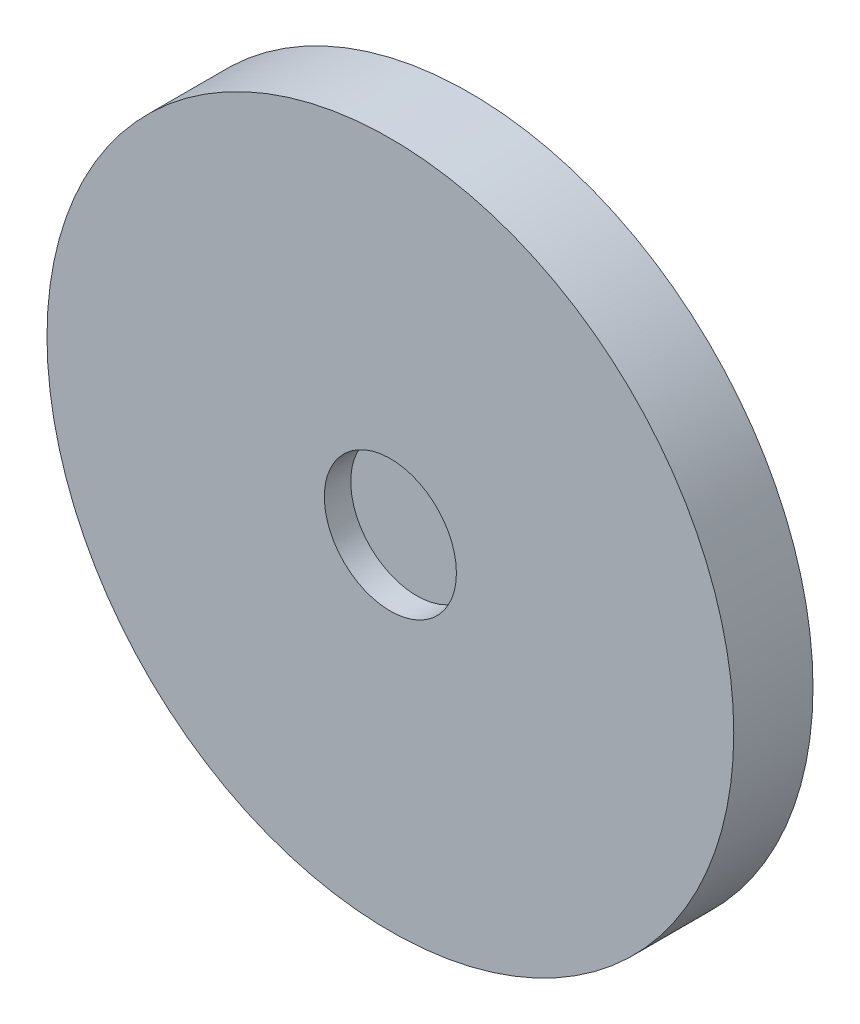
ISO-10303-21;
HEADER;
FILE_DESCRIPTION(('STEP AP214'),'2;1');
FILE_NAME('part.step','',(''),(''),'','','');
FILE_SCHEMA(('AUTOMOTIVE_DESIGN { 1 0 10303 214 1 1 1 1 }'));
ENDSEC;
DATA;
#1=APPLICATION_CONTEXT('core data for automotive mechanical design processes');
#2=APPLICATION_PROTOCOL_DEFINITION('international standard','automotive_design',2000,#1);
#3=PRODUCT_CONTEXT('',#1,'mechanical');
#4=PRODUCT('Part','Part','',(#3));
#5=PRODUCT_RELATED_PRODUCT_CATEGORY('part','',(#4));
#6=PRODUCT_DEFINITION_FORMATION('','',#4);
#7=PRODUCT_DEFINITION_CONTEXT('part definition',#1,'design');
#8=PRODUCT_DEFINITION('design','',#6,#7);
#9=PRODUCT_DEFINITION_SHAPE('','',#8);
#10=(LENGTH_UNIT() NAMED_UNIT(*) SI_UNIT(.MILLI.,.METRE.));
#11=(NAMED_UNIT(*) PLANE_ANGLE_UNIT() SI_UNIT($,.RADIAN.));
#12=(NAMED_UNIT(*) SI_UNIT($,.STERADIAN.) SOLID_ANGLE_UNIT());
#13=UNCERTAINTY_MEASURE_WITH_UNIT(LENGTH_MEASURE(1.E-05),#10,'distance_accuracy_value','');
#14=(GEOMETRIC_REPRESENTATION_CONTEXT(3) GLOBAL_UNCERTAINTY_ASSIGNED_CONTEXT((#13)) GLOBAL_UNIT_ASSIGNED_CONTEXT((#10,
#11,#12)) REPRESENTATION_CONTEXT('',''));
#15=CARTESIAN_POINT('',(0.,0.,0.));
#16=DIRECTION('',(0.,0.,1.));
#17=DIRECTION('',(1.,0.,0.));
#18=AXIS2_PLACEMENT_3D('',#15,#16,#17);
#19=CARTESIAN_POINT('',(0.,0.,0.6));
#20=DIRECTION('',(0.,0.,1.));
#21=DIRECTION('',(1.,0.,0.));
#22=AXIS2_PLACEMENT_3D('',#19,#20,#21);
#23=PLANE('',#22);
#24=CARTESIAN_POINT('',(0.,0.,0.6));
#25=DIRECTION('',(0.,0.,1.));
#26=DIRECTION('',(1.,0.,0.));
#27=AXIS2_PLACEMENT_3D('',#24,#25,#26);
#28=CIRCLE('',#27,0.75);
#29=CARTESIAN_POINT('',(0.75,0.,0.6));
#30=VERTEX_POINT('',#29);
#31=EDGE_CURVE('E18',#30,#30,#28,.T.);
#32=ORIENTED_EDGE('',*,*,#31,.T.);
#33=EDGE_LOOP('',(#32));
#34=FACE_BOUND('',#33,.T.);
#35=ADVANCED_FACE('F15',(#34),#23,.T.);
#36=CARTESIAN_POINT('',(0.,0.,0.6));
#37=DIRECTION('',(0.,0.,1.));
#38=DIRECTION('',(1.,0.,0.));
#39=AXIS2_PLACEMENT_3D('',#36,#37,#38);
#40=CYLINDRICAL_SURFACE('',#39,0.75);
#41=CARTESIAN_POINT('',(0.,0.,0.9));
#42=DIRECTION('',(0.,0.,1.));
#43=DIRECTION('',(1.,0.,0.));
#44=AXIS2_PLACEMENT_3D('',#41,#42,#43);
#45=CIRCLE('',#44,0.75);
#46=CARTESIAN_POINT('',(0.75,0.,0.9));
#47=VERTEX_POINT('',#46);
#48=EDGE_CURVE('E27',#47,#47,#45,.F.);
#49=ORIENTED_EDGE('',*,*,#48,.F.);
#50=EDGE_LOOP('',(#49));
#51=FACE_BOUND('',#50,.T.);
#52=ORIENTED_EDGE('',*,*,#31,.F.);
#53=EDGE_LOOP('',(#52));
#54=FACE_BOUND('',#53,.T.);
#55=ADVANCED_FACE('F36',(#51,#54),#40,.F.);
#56=CARTESIAN_POINT('',(0.,0.,0.9));
#57=DIRECTION('',(0.,0.,1.));
#58=DIRECTION('',(1.,0.,0.));
#59=AXIS2_PLACEMENT_3D('',#56,#57,#58);
#60=PLANE('',#59);
#61=CARTESIAN_POINT('',(0.,0.,0.9));
#62=DIRECTION('',(0.,0.,-1.));
#63=DIRECTION('',(-1.,0.,0.));
#64=AXIS2_PLACEMENT_3D('',#61,#62,#63);
#65=CIRCLE('',#64,3.9);
#66=CARTESIAN_POINT('',(-3.9,0.,0.9));
#67=VERTEX_POINT('',#66);
#68=EDGE_CURVE('E22',#67,#67,#65,.T.);
#69=ORIENTED_EDGE('',*,*,#68,.F.);
#70=EDGE_LOOP('',(#69));
#71=FACE_BOUND('',#70,.T.);
#72=ORIENTED_EDGE('',*,*,#48,.T.);
#73=EDGE_LOOP('',(#72));
#74=FACE_BOUND('',#73,.T.);
#75=ADVANCED_FACE('F38',(#71,#74),#60,.T.);
#76=CARTESIAN_POINT('',(0.,0.,0.9));
#77=DIRECTION('',(0.,0.,-1.));
#78=DIRECTION('',(-1.,0.,0.));
#79=AXIS2_PLACEMENT_3D('',#76,#77,#78);
#80=CYLINDRICAL_SURFACE('',#79,3.9);
#81=ORIENTED_EDGE('',*,*,#68,.T.);
#82=EDGE_LOOP('',(#81));
#83=FACE_BOUND('',#82,.T.);
#84=CARTESIAN_POINT('',(0.,0.,0.));
#85=DIRECTION('',(0.,0.,-1.));
#86=DIRECTION('',(-1.,0.,0.));
#87=AXIS2_PLACEMENT_3D('',#84,#85,#86);
#88=CIRCLE('',#87,3.9);
#89=CARTESIAN_POINT('',(-3.9,0.,0.));
#90=VERTEX_POINT('',#89);
#91=EDGE_CURVE('E10',#90,#90,#88,.F.);
#92=ORIENTED_EDGE('',*,*,#91,.T.);
#93=EDGE_LOOP('',(#92));
#94=FACE_BOUND('',#93,.T.);
#95=ADVANCED_FACE('F45',(#83,#94),#80,.T.);
#96=CARTESIAN_POINT('',(0.,0.,0.));
#97=DIRECTION('',(0.,0.,1.));
#98=DIRECTION('',(1.,0.,0.));
#99=AXIS2_PLACEMENT_3D('',#96,#97,#98);
#100=PLANE('',#99);
#101=ORIENTED_EDGE('',*,*,#91,.F.);
#102=EDGE_LOOP('',(#101));
#103=FACE_BOUND('',#102,.T.);
#104=ADVANCED_FACE('F48',(#103),#100,.F.);
#105=CLOSED_SHELL('',(#35,#55,#75,#95,#104));
#106=MANIFOLD_SOLID_BREP('B1',#105);
#107=ADVANCED_BREP_SHAPE_REPRESENTATION('',(#18,#106),#14);
#108=SHAPE_DEFINITION_REPRESENTATION(#9,#107);
ENDSEC;
END-ISO-10303-21;
